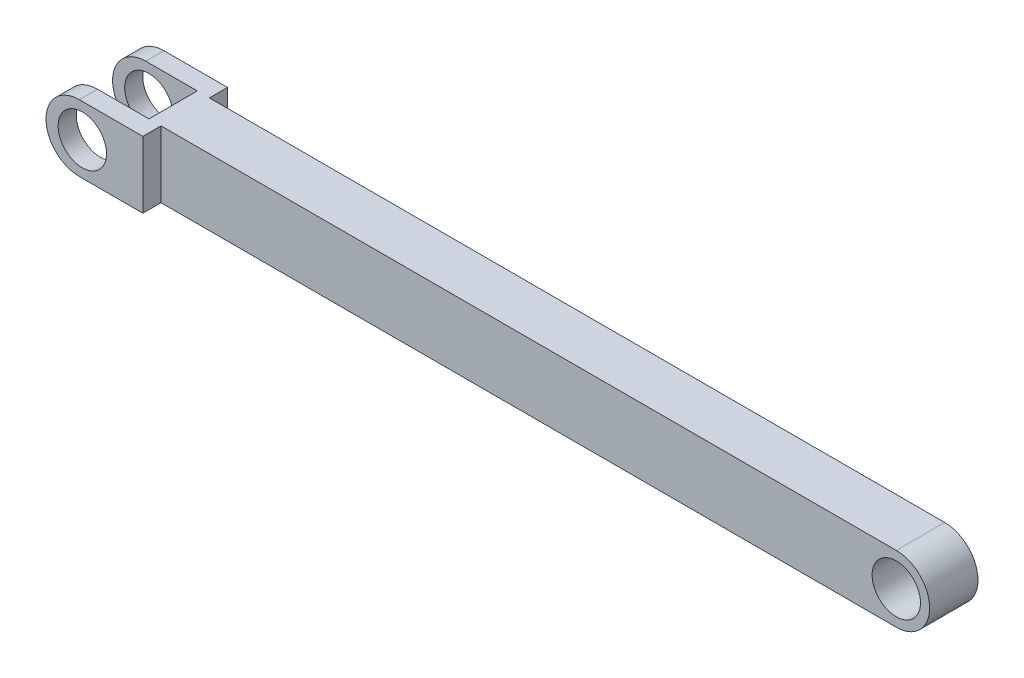
ISO-10303-21;
HEADER;
FILE_DESCRIPTION(('STEP AP214'),'2;1');
FILE_NAME('part.step','',(''),(''),'','','');
FILE_SCHEMA(('AUTOMOTIVE_DESIGN { 1 0 10303 214 1 1 1 1 }'));
ENDSEC;
DATA;
#1=APPLICATION_CONTEXT('core data for automotive mechanical design processes');
#2=APPLICATION_PROTOCOL_DEFINITION('international standard','automotive_design',2000,#1);
#3=PRODUCT_CONTEXT('',#1,'mechanical');
#4=PRODUCT('Part','Part','',(#3));
#5=PRODUCT_RELATED_PRODUCT_CATEGORY('part','',(#4));
#6=PRODUCT_DEFINITION_FORMATION('','',#4);
#7=PRODUCT_DEFINITION_CONTEXT('part definition',#1,'design');
#8=PRODUCT_DEFINITION('design','',#6,#7);
#9=PRODUCT_DEFINITION_SHAPE('','',#8);
#10=(LENGTH_UNIT() NAMED_UNIT(*) SI_UNIT(.MILLI.,.METRE.));
#11=(NAMED_UNIT(*) PLANE_ANGLE_UNIT() SI_UNIT($,.RADIAN.));
#12=(NAMED_UNIT(*) SI_UNIT($,.STERADIAN.) SOLID_ANGLE_UNIT());
#13=UNCERTAINTY_MEASURE_WITH_UNIT(LENGTH_MEASURE(1.E-05),#10,'distance_accuracy_value','');
#14=(GEOMETRIC_REPRESENTATION_CONTEXT(3) GLOBAL_UNCERTAINTY_ASSIGNED_CONTEXT((#13)) GLOBAL_UNIT_ASSIGNED_CONTEXT((#10,
#11,#12)) REPRESENTATION_CONTEXT('',''));
#15=CARTESIAN_POINT('',(0.,0.,0.));
#16=DIRECTION('',(0.,0.,1.));
#17=DIRECTION('',(1.,0.,0.));
#18=AXIS2_PLACEMENT_3D('',#15,#16,#17);
#19=CARTESIAN_POINT('',(0.,0.,4.));
#20=DIRECTION('',(0.,0.,-1.));
#21=DIRECTION('',(-1.,0.,0.));
#22=AXIS2_PLACEMENT_3D('',#19,#20,#21);
#23=PLANE('',#22);
#24=CARTESIAN_POINT('',(0.,0.,4.));
#25=DIRECTION('',(0.,0.,1.));
#26=DIRECTION('',(-1.,0.,0.));
#27=AXIS2_PLACEMENT_3D('',#24,#25,#26);
#28=CIRCLE('',#27,2.75);
#29=CARTESIAN_POINT('',(0.,-2.75,4.));
#30=VERTEX_POINT('',#29);
#31=CARTESIAN_POINT('',(0.,2.75,4.));
#32=VERTEX_POINT('',#31);
#33=EDGE_CURVE('E202',#30,#32,#28,.T.);
#34=ORIENTED_EDGE('',*,*,#33,.T.);
#35=DIRECTION('',(-1.,0.,0.));
#36=VECTOR('',#35,1.);
#37=CARTESIAN_POINT('',(0.,2.75,4.));
#38=LINE('',#37,#36);
#39=CARTESIAN_POINT('',(-60.75,2.75,4.));
#40=VERTEX_POINT('',#39);
#41=EDGE_CURVE('E205',#32,#40,#38,.T.);
#42=ORIENTED_EDGE('',*,*,#41,.T.);
#43=DIRECTION('',(0.,-1.,0.));
#44=VECTOR('',#43,1.);
#45=CARTESIAN_POINT('',(-60.75,2.74999999999999,4.));
#46=LINE('',#45,#44);
#47=CARTESIAN_POINT('',(-60.75,-2.75,4.));
#48=VERTEX_POINT('',#47);
#49=EDGE_CURVE('E209',#40,#48,#46,.T.);
#50=ORIENTED_EDGE('',*,*,#49,.T.);
#51=DIRECTION('',(1.,0.,0.));
#52=VECTOR('',#51,1.);
#53=CARTESIAN_POINT('',(-60.75,-2.75,4.));
#54=LINE('',#53,#52);
#55=EDGE_CURVE('E212',#48,#30,#54,.T.);
#56=ORIENTED_EDGE('',*,*,#55,.T.);
#57=EDGE_LOOP('',(#34,#42,#50,#56));
#58=FACE_BOUND('',#57,.T.);
#59=CARTESIAN_POINT('',(0.,0.,4.));
#60=DIRECTION('',(0.,0.,1.));
#61=DIRECTION('',(1.,0.,0.));
#62=AXIS2_PLACEMENT_3D('',#59,#60,#61);
#63=CIRCLE('',#62,2.);
#64=CARTESIAN_POINT('',(2.,0.,4.));
#65=VERTEX_POINT('',#64);
#66=EDGE_CURVE('E196',#65,#65,#63,.T.);
#67=ORIENTED_EDGE('',*,*,#66,.F.);
#68=EDGE_LOOP('',(#67));
#69=FACE_BOUND('',#68,.T.);
#70=ADVANCED_FACE('F37',(#58,#69),#23,.F.);
#71=CARTESIAN_POINT('',(0.,0.,0.));
#72=DIRECTION('',(0.,0.,-1.));
#73=DIRECTION('',(-1.,0.,0.));
#74=AXIS2_PLACEMENT_3D('',#71,#72,#73);
#75=PLANE('',#74);
#76=CARTESIAN_POINT('',(0.,0.,0.));
#77=DIRECTION('',(0.,0.,1.));
#78=DIRECTION('',(-1.,0.,0.));
#79=AXIS2_PLACEMENT_3D('',#76,#77,#78);
#80=CIRCLE('',#79,2.75);
#81=CARTESIAN_POINT('',(0.,-2.75,0.));
#82=VERTEX_POINT('',#81);
#83=CARTESIAN_POINT('',(0.,2.75,0.));
#84=VERTEX_POINT('',#83);
#85=EDGE_CURVE('E199',#82,#84,#80,.T.);
#86=ORIENTED_EDGE('',*,*,#85,.F.);
#87=DIRECTION('',(1.,0.,0.));
#88=VECTOR('',#87,1.);
#89=CARTESIAN_POINT('',(-60.75,-2.75,0.));
#90=LINE('',#89,#88);
#91=CARTESIAN_POINT('',(-60.75,-2.75,0.));
#92=VERTEX_POINT('',#91);
#93=EDGE_CURVE('E206',#92,#82,#90,.T.);
#94=ORIENTED_EDGE('',*,*,#93,.F.);
#95=DIRECTION('',(0.,-1.,0.));
#96=VECTOR('',#95,1.);
#97=CARTESIAN_POINT('',(-60.75,2.74999999999999,0.));
#98=LINE('',#97,#96);
#99=CARTESIAN_POINT('',(-60.75,2.75,0.));
#100=VERTEX_POINT('',#99);
#101=EDGE_CURVE('E220',#100,#92,#98,.T.);
#102=ORIENTED_EDGE('',*,*,#101,.F.);
#103=DIRECTION('',(-1.,0.,0.));
#104=VECTOR('',#103,1.);
#105=CARTESIAN_POINT('',(0.,2.75,0.));
#106=LINE('',#105,#104);
#107=EDGE_CURVE('E217',#84,#100,#106,.T.);
#108=ORIENTED_EDGE('',*,*,#107,.F.);
#109=EDGE_LOOP('',(#86,#94,#102,#108));
#110=FACE_BOUND('',#109,.T.);
#111=CARTESIAN_POINT('',(0.,0.,0.));
#112=DIRECTION('',(0.,0.,1.));
#113=DIRECTION('',(1.,0.,0.));
#114=AXIS2_PLACEMENT_3D('',#111,#112,#113);
#115=CIRCLE('',#114,2.);
#116=CARTESIAN_POINT('',(2.,0.,0.));
#117=VERTEX_POINT('',#116);
#118=EDGE_CURVE('E195',#117,#117,#115,.T.);
#119=ORIENTED_EDGE('',*,*,#118,.T.);
#120=EDGE_LOOP('',(#119));
#121=FACE_BOUND('',#120,.T.);
#122=ADVANCED_FACE('F300',(#110,#121),#75,.T.);
#123=CARTESIAN_POINT('',(0.,0.,4.));
#124=DIRECTION('',(0.,0.,-1.));
#125=DIRECTION('',(-1.,0.,0.));
#126=AXIS2_PLACEMENT_3D('',#123,#124,#125);
#127=CYLINDRICAL_SURFACE('',#126,2.75);
#128=ORIENTED_EDGE('',*,*,#85,.T.);
#129=DIRECTION('',(0.,0.,-1.));
#130=VECTOR('',#129,1.);
#131=CARTESIAN_POINT('',(0.,2.75,4.));
#132=LINE('',#131,#130);
#133=EDGE_CURVE('E225',#32,#84,#132,.T.);
#134=ORIENTED_EDGE('',*,*,#133,.F.);
#135=ORIENTED_EDGE('',*,*,#33,.F.);
#136=DIRECTION('',(0.,0.,-1.));
#137=VECTOR('',#136,1.);
#138=CARTESIAN_POINT('',(0.,-2.75,4.));
#139=LINE('',#138,#137);
#140=EDGE_CURVE('E214',#30,#82,#139,.T.);
#141=ORIENTED_EDGE('',*,*,#140,.T.);
#142=EDGE_LOOP('',(#128,#134,#135,#141));
#143=FACE_BOUND('',#142,.T.);
#144=ADVANCED_FACE('F294',(#143),#127,.T.);
#145=CARTESIAN_POINT('',(0.,2.75,4.));
#146=DIRECTION('',(0.,-1.,0.));
#147=DIRECTION('',(1.,0.,0.));
#148=AXIS2_PLACEMENT_3D('',#145,#146,#147);
#149=PLANE('',#148);
#150=DIRECTION('',(1.,0.,0.));
#151=VECTOR('',#150,1.);
#152=CARTESIAN_POINT('',(-68.75,2.75,-1.5));
#153=LINE('',#152,#151);
#154=CARTESIAN_POINT('',(-66.,2.75,-1.5));
#155=VERTEX_POINT('',#154);
#156=CARTESIAN_POINT('',(-60.75,2.75,-1.5));
#157=VERTEX_POINT('',#156);
#158=EDGE_CURVE('E187',#155,#157,#153,.T.);
#159=ORIENTED_EDGE('',*,*,#158,.F.);
#160=DIRECTION('',(0.,0.,-1.));
#161=VECTOR('',#160,1.);
#162=CARTESIAN_POINT('',(-66.,2.74999999999999,0.));
#163=LINE('',#162,#161);
#164=CARTESIAN_POINT('',(-66.,2.75,0.));
#165=VERTEX_POINT('',#164);
#166=EDGE_CURVE('E11',#155,#165,#163,.F.);
#167=ORIENTED_EDGE('',*,*,#166,.T.);
#168=DIRECTION('',(-1.,0.,0.));
#169=VECTOR('',#168,1.);
#170=CARTESIAN_POINT('',(-68.75,2.75,0.));
#171=LINE('',#170,#169);
#172=CARTESIAN_POINT('',(-61.75,2.75,0.));
#173=VERTEX_POINT('',#172);
#174=EDGE_CURVE('E162',#173,#165,#171,.T.);
#175=ORIENTED_EDGE('',*,*,#174,.F.);
#176=DIRECTION('',(0.,0.,-1.));
#177=VECTOR('',#176,1.);
#178=CARTESIAN_POINT('',(-61.75,2.75,0.));
#179=LINE('',#178,#177);
#180=CARTESIAN_POINT('',(-61.75,2.75,4.));
#181=VERTEX_POINT('',#180);
#182=EDGE_CURVE('E148',#181,#173,#179,.T.);
#183=ORIENTED_EDGE('',*,*,#182,.F.);
#184=DIRECTION('',(1.,0.,0.));
#185=VECTOR('',#184,1.);
#186=CARTESIAN_POINT('',(-68.75,2.75,4.));
#187=LINE('',#186,#185);
#188=CARTESIAN_POINT('',(-66.,2.75,4.));
#189=VERTEX_POINT('',#188);
#190=EDGE_CURVE('E137',#189,#181,#187,.T.);
#191=ORIENTED_EDGE('',*,*,#190,.F.);
#192=DIRECTION('',(0.,0.,-1.));
#193=VECTOR('',#192,1.);
#194=CARTESIAN_POINT('',(-66.,2.74999999999999,5.5));
#195=LINE('',#194,#193);
#196=CARTESIAN_POINT('',(-66.,2.75,5.5));
#197=VERTEX_POINT('',#196);
#198=EDGE_CURVE('E46',#189,#197,#195,.F.);
#199=ORIENTED_EDGE('',*,*,#198,.T.);
#200=DIRECTION('',(1.,0.,0.));
#201=VECTOR('',#200,1.);
#202=CARTESIAN_POINT('',(-68.75,2.75,5.5));
#203=LINE('',#202,#201);
#204=CARTESIAN_POINT('',(-60.75,2.75,5.5));
#205=VERTEX_POINT('',#204);
#206=EDGE_CURVE('E189',#197,#205,#203,.T.);
#207=ORIENTED_EDGE('',*,*,#206,.T.);
#208=DIRECTION('',(0.,0.,-1.));
#209=VECTOR('',#208,1.);
#210=CARTESIAN_POINT('',(-60.75,2.75,-1.5));
#211=LINE('',#210,#209);
#212=EDGE_CURVE('E184',#205,#40,#211,.T.);
#213=ORIENTED_EDGE('',*,*,#212,.T.);
#214=ORIENTED_EDGE('',*,*,#41,.F.);
#215=ORIENTED_EDGE('',*,*,#133,.T.);
#216=ORIENTED_EDGE('',*,*,#107,.T.);
#217=EDGE_CURVE('E183',#100,#157,#211,.T.);
#218=ORIENTED_EDGE('',*,*,#217,.T.);
#219=EDGE_LOOP('',(#159,#167,#175,#183,#191,#199,#207,#213,#214,#215,#216,#218));
#220=FACE_BOUND('',#219,.T.);
#221=ADVANCED_FACE('F160',(#220),#149,.F.);
#222=CARTESIAN_POINT('',(-60.75,-2.75,4.));
#223=DIRECTION('',(0.,1.,0.));
#224=DIRECTION('',(0.,0.,1.));
#225=AXIS2_PLACEMENT_3D('',#222,#223,#224);
#226=PLANE('',#225);
#227=DIRECTION('',(1.,0.,0.));
#228=VECTOR('',#227,1.);
#229=CARTESIAN_POINT('',(-68.75,-2.75,5.5));
#230=LINE('',#229,#228);
#231=CARTESIAN_POINT('',(-66.,-2.75,5.5));
#232=VERTEX_POINT('',#231);
#233=CARTESIAN_POINT('',(-60.75,-2.75,5.5));
#234=VERTEX_POINT('',#233);
#235=EDGE_CURVE('E191',#232,#234,#230,.T.);
#236=ORIENTED_EDGE('',*,*,#235,.F.);
#237=DIRECTION('',(0.,0.,1.));
#238=VECTOR('',#237,1.);
#239=CARTESIAN_POINT('',(-66.,-2.75,4.));
#240=LINE('',#239,#238);
#241=CARTESIAN_POINT('',(-66.,-2.75,4.));
#242=VERTEX_POINT('',#241);
#243=EDGE_CURVE('E239',#232,#242,#240,.F.);
#244=ORIENTED_EDGE('',*,*,#243,.T.);
#245=DIRECTION('',(1.,0.,0.));
#246=VECTOR('',#245,1.);
#247=CARTESIAN_POINT('',(-68.75,-2.75,4.));
#248=LINE('',#247,#246);
#249=CARTESIAN_POINT('',(-61.75,-2.75,4.));
#250=VERTEX_POINT('',#249);
#251=EDGE_CURVE('E164',#242,#250,#248,.T.);
#252=ORIENTED_EDGE('',*,*,#251,.T.);
#253=DIRECTION('',(0.,0.,-1.));
#254=VECTOR('',#253,1.);
#255=CARTESIAN_POINT('',(-61.75,-2.75,0.));
#256=LINE('',#255,#254);
#257=CARTESIAN_POINT('',(-61.75,-2.75,0.));
#258=VERTEX_POINT('',#257);
#259=EDGE_CURVE('E156',#250,#258,#256,.T.);
#260=ORIENTED_EDGE('',*,*,#259,.T.);
#261=DIRECTION('',(-1.,0.,0.));
#262=VECTOR('',#261,1.);
#263=CARTESIAN_POINT('',(-68.75,-2.75,0.));
#264=LINE('',#263,#262);
#265=CARTESIAN_POINT('',(-66.,-2.75,0.));
#266=VERTEX_POINT('',#265);
#267=EDGE_CURVE('E158',#258,#266,#264,.T.);
#268=ORIENTED_EDGE('',*,*,#267,.T.);
#269=DIRECTION('',(0.,0.,1.));
#270=VECTOR('',#269,1.);
#271=CARTESIAN_POINT('',(-66.,-2.75,-1.5));
#272=LINE('',#271,#270);
#273=CARTESIAN_POINT('',(-66.,-2.75,-1.5));
#274=VERTEX_POINT('',#273);
#275=EDGE_CURVE('E236',#266,#274,#272,.F.);
#276=ORIENTED_EDGE('',*,*,#275,.T.);
#277=DIRECTION('',(1.,0.,0.));
#278=VECTOR('',#277,1.);
#279=CARTESIAN_POINT('',(-68.75,-2.75,-1.5));
#280=LINE('',#279,#278);
#281=CARTESIAN_POINT('',(-60.75,-2.75,-1.5));
#282=VERTEX_POINT('',#281);
#283=EDGE_CURVE('E193',#274,#282,#280,.T.);
#284=ORIENTED_EDGE('',*,*,#283,.T.);
#285=DIRECTION('',(0.,0.,1.));
#286=VECTOR('',#285,1.);
#287=CARTESIAN_POINT('',(-60.75,-2.75,-1.5));
#288=LINE('',#287,#286);
#289=EDGE_CURVE('E177',#282,#92,#288,.T.);
#290=ORIENTED_EDGE('',*,*,#289,.T.);
#291=ORIENTED_EDGE('',*,*,#93,.T.);
#292=ORIENTED_EDGE('',*,*,#140,.F.);
#293=ORIENTED_EDGE('',*,*,#55,.F.);
#294=EDGE_CURVE('E176',#48,#234,#288,.T.);
#295=ORIENTED_EDGE('',*,*,#294,.T.);
#296=EDGE_LOOP('',(#236,#244,#252,#260,#268,#276,#284,#290,#291,#292,#293,#295));
#297=FACE_BOUND('',#296,.T.);
#298=ADVANCED_FACE('F274',(#297),#226,.F.);
#299=CARTESIAN_POINT('',(0.,0.,4.));
#300=DIRECTION('',(0.,0.,-1.));
#301=DIRECTION('',(-1.,0.,0.));
#302=AXIS2_PLACEMENT_3D('',#299,#300,#301);
#303=CYLINDRICAL_SURFACE('',#302,2.);
#304=ORIENTED_EDGE('',*,*,#66,.T.);
#305=EDGE_LOOP('',(#304));
#306=FACE_BOUND('',#305,.T.);
#307=ORIENTED_EDGE('',*,*,#118,.F.);
#308=EDGE_LOOP('',(#307));
#309=FACE_BOUND('',#308,.T.);
#310=ADVANCED_FACE('F315',(#306,#309),#303,.F.);
#311=CARTESIAN_POINT('',(-60.75,0.,0.));
#312=DIRECTION('',(-1.,0.,0.));
#313=DIRECTION('',(0.,0.,1.));
#314=AXIS2_PLACEMENT_3D('',#311,#312,#313);
#315=PLANE('',#314);
#316=ORIENTED_EDGE('',*,*,#217,.F.);
#317=ORIENTED_EDGE('',*,*,#101,.T.);
#318=ORIENTED_EDGE('',*,*,#289,.F.);
#319=DIRECTION('',(0.,-1.,0.));
#320=VECTOR('',#319,1.);
#321=CARTESIAN_POINT('',(-60.75,2.75,-1.5));
#322=LINE('',#321,#320);
#323=EDGE_CURVE('E172',#157,#282,#322,.T.);
#324=ORIENTED_EDGE('',*,*,#323,.F.);
#325=EDGE_LOOP('',(#316,#317,#318,#324));
#326=FACE_BOUND('',#325,.T.);
#327=ADVANCED_FACE('F304',(#326),#315,.F.);
#328=CARTESIAN_POINT('',(-68.75,2.75,-1.5));
#329=DIRECTION('',(0.,0.,1.));
#330=DIRECTION('',(0.,-1.,0.));
#331=AXIS2_PLACEMENT_3D('',#328,#329,#330);
#332=PLANE('',#331);
#333=CARTESIAN_POINT('',(-65.75,0.,-1.5));
#334=DIRECTION('',(0.,0.,1.));
#335=DIRECTION('',(1.,0.,0.));
#336=AXIS2_PLACEMENT_3D('',#333,#334,#335);
#337=CIRCLE('',#336,2.);
#338=CARTESIAN_POINT('',(-63.75,0.,-1.5));
#339=VERTEX_POINT('',#338);
#340=EDGE_CURVE('E232',#339,#339,#337,.T.);
#341=ORIENTED_EDGE('',*,*,#340,.T.);
#342=EDGE_LOOP('',(#341));
#343=FACE_BOUND('',#342,.T.);
#344=ORIENTED_EDGE('',*,*,#283,.F.);
#345=CARTESIAN_POINT('',(-66.,0.,-1.5));
#346=DIRECTION('',(0.,0.,1.));
#347=DIRECTION('',(0.,-1.,0.));
#348=AXIS2_PLACEMENT_3D('',#345,#346,#347);
#349=CIRCLE('',#348,2.75);
#350=CARTESIAN_POINT('',(-68.75,0.,-1.5));
#351=VERTEX_POINT('',#350);
#352=EDGE_CURVE('E59',#274,#351,#349,.F.);
#353=ORIENTED_EDGE('',*,*,#352,.T.);
#354=CARTESIAN_POINT('',(-66.,0.,-1.5));
#355=DIRECTION('',(0.,0.,1.));
#356=DIRECTION('',(0.,-1.,0.));
#357=AXIS2_PLACEMENT_3D('',#354,#355,#356);
#358=CIRCLE('',#357,2.75);
#359=EDGE_CURVE('E54',#351,#155,#358,.F.);
#360=ORIENTED_EDGE('',*,*,#359,.T.);
#361=ORIENTED_EDGE('',*,*,#158,.T.);
#362=ORIENTED_EDGE('',*,*,#323,.T.);
#363=EDGE_LOOP('',(#344,#353,#360,#361,#362));
#364=FACE_BOUND('',#363,.T.);
#365=ADVANCED_FACE('F305',(#343,#364),#332,.F.);
#366=CARTESIAN_POINT('',(-68.75,2.75,5.5));
#367=DIRECTION('',(0.,0.,-1.));
#368=DIRECTION('',(-1.,0.,0.));
#369=AXIS2_PLACEMENT_3D('',#366,#367,#368);
#370=PLANE('',#369);
#371=CARTESIAN_POINT('',(-65.75,0.,5.5));
#372=DIRECTION('',(0.,0.,1.));
#373=DIRECTION('',(1.,0.,0.));
#374=AXIS2_PLACEMENT_3D('',#371,#372,#373);
#375=CIRCLE('',#374,2.);
#376=CARTESIAN_POINT('',(-63.75,0.,5.5));
#377=VERTEX_POINT('',#376);
#378=EDGE_CURVE('E253',#377,#377,#375,.T.);
#379=ORIENTED_EDGE('',*,*,#378,.F.);
#380=EDGE_LOOP('',(#379));
#381=FACE_BOUND('',#380,.T.);
#382=CARTESIAN_POINT('',(-66.,0.,5.5));
#383=DIRECTION('',(0.,0.,-1.));
#384=DIRECTION('',(-1.,0.,0.));
#385=AXIS2_PLACEMENT_3D('',#382,#383,#384);
#386=CIRCLE('',#385,2.75);
#387=CARTESIAN_POINT('',(-68.75,0.,5.5));
#388=VERTEX_POINT('',#387);
#389=EDGE_CURVE('E228',#197,#388,#386,.F.);
#390=ORIENTED_EDGE('',*,*,#389,.T.);
#391=CARTESIAN_POINT('',(-66.,0.,5.5));
#392=DIRECTION('',(0.,0.,-1.));
#393=DIRECTION('',(-1.,0.,0.));
#394=AXIS2_PLACEMENT_3D('',#391,#392,#393);
#395=CIRCLE('',#394,2.75);
#396=EDGE_CURVE('E234',#388,#232,#395,.F.);
#397=ORIENTED_EDGE('',*,*,#396,.T.);
#398=ORIENTED_EDGE('',*,*,#235,.T.);
#399=DIRECTION('',(0.,1.,0.));
#400=VECTOR('',#399,1.);
#401=CARTESIAN_POINT('',(-60.75,2.75,5.5));
#402=LINE('',#401,#400);
#403=EDGE_CURVE('E180',#234,#205,#402,.T.);
#404=ORIENTED_EDGE('',*,*,#403,.T.);
#405=ORIENTED_EDGE('',*,*,#206,.F.);
#406=EDGE_LOOP('',(#390,#397,#398,#404,#405));
#407=FACE_BOUND('',#406,.T.);
#408=ADVANCED_FACE('F281',(#381,#407),#370,.F.);
#409=ORIENTED_EDGE('',*,*,#49,.F.);
#410=ORIENTED_EDGE('',*,*,#212,.F.);
#411=ORIENTED_EDGE('',*,*,#403,.F.);
#412=ORIENTED_EDGE('',*,*,#294,.F.);
#413=EDGE_LOOP('',(#409,#410,#411,#412));
#414=FACE_BOUND('',#413,.T.);
#415=ADVANCED_FACE('F286',(#414),#315,.F.);
#416=CARTESIAN_POINT('',(-68.75,-2.75,0.));
#417=DIRECTION('',(0.,0.,-1.));
#418=DIRECTION('',(-1.,0.,0.));
#419=AXIS2_PLACEMENT_3D('',#416,#417,#418);
#420=PLANE('',#419);
#421=CARTESIAN_POINT('',(-65.75,0.,0.));
#422=DIRECTION('',(0.,0.,-1.));
#423=DIRECTION('',(-1.,0.,0.));
#424=AXIS2_PLACEMENT_3D('',#421,#422,#423);
#425=CIRCLE('',#424,2.);
#426=CARTESIAN_POINT('',(-67.75,0.,0.));
#427=VERTEX_POINT('',#426);
#428=EDGE_CURVE('E149',#427,#427,#425,.T.);
#429=ORIENTED_EDGE('',*,*,#428,.T.);
#430=EDGE_LOOP('',(#429));
#431=FACE_BOUND('',#430,.T.);
#432=CARTESIAN_POINT('',(-66.,0.,0.));
#433=DIRECTION('',(0.,0.,-1.));
#434=DIRECTION('',(-1.,0.,0.));
#435=AXIS2_PLACEMENT_3D('',#432,#433,#434);
#436=CIRCLE('',#435,2.75);
#437=CARTESIAN_POINT('',(-68.75,0.,0.));
#438=VERTEX_POINT('',#437);
#439=EDGE_CURVE('E245',#165,#438,#436,.F.);
#440=ORIENTED_EDGE('',*,*,#439,.T.);
#441=CARTESIAN_POINT('',(-66.,0.,0.));
#442=DIRECTION('',(0.,0.,-1.));
#443=DIRECTION('',(-1.,0.,0.));
#444=AXIS2_PLACEMENT_3D('',#441,#442,#443);
#445=CIRCLE('',#444,2.75);
#446=EDGE_CURVE('E247',#438,#266,#445,.F.);
#447=ORIENTED_EDGE('',*,*,#446,.T.);
#448=ORIENTED_EDGE('',*,*,#267,.F.);
#449=DIRECTION('',(0.,1.,0.));
#450=VECTOR('',#449,1.);
#451=CARTESIAN_POINT('',(-61.75,-2.75,0.));
#452=LINE('',#451,#450);
#453=EDGE_CURVE('E157',#258,#173,#452,.T.);
#454=ORIENTED_EDGE('',*,*,#453,.T.);
#455=ORIENTED_EDGE('',*,*,#174,.T.);
#456=EDGE_LOOP('',(#440,#447,#448,#454,#455));
#457=FACE_BOUND('',#456,.T.);
#458=ADVANCED_FACE('F270',(#431,#457),#420,.F.);
#459=CARTESIAN_POINT('',(-61.75,-2.75,0.));
#460=DIRECTION('',(1.,0.,0.));
#461=DIRECTION('',(0.,0.,-1.));
#462=AXIS2_PLACEMENT_3D('',#459,#460,#461);
#463=PLANE('',#462);
#464=ORIENTED_EDGE('',*,*,#453,.F.);
#465=ORIENTED_EDGE('',*,*,#259,.F.);
#466=DIRECTION('',(0.,1.,0.));
#467=VECTOR('',#466,1.);
#468=CARTESIAN_POINT('',(-61.75,-2.75,4.));
#469=LINE('',#468,#467);
#470=EDGE_CURVE('E141',#250,#181,#469,.T.);
#471=ORIENTED_EDGE('',*,*,#470,.T.);
#472=ORIENTED_EDGE('',*,*,#182,.T.);
#473=EDGE_LOOP('',(#464,#465,#471,#472));
#474=FACE_BOUND('',#473,.T.);
#475=ADVANCED_FACE('F153',(#474),#463,.F.);
#476=CARTESIAN_POINT('',(-68.75,-2.75,4.));
#477=DIRECTION('',(0.,0.,1.));
#478=DIRECTION('',(1.,0.,0.));
#479=AXIS2_PLACEMENT_3D('',#476,#477,#478);
#480=PLANE('',#479);
#481=CARTESIAN_POINT('',(-65.75,0.,4.));
#482=DIRECTION('',(0.,0.,1.));
#483=DIRECTION('',(1.,0.,0.));
#484=AXIS2_PLACEMENT_3D('',#481,#482,#483);
#485=CIRCLE('',#484,2.);
#486=CARTESIAN_POINT('',(-63.75,0.,4.));
#487=VERTEX_POINT('',#486);
#488=EDGE_CURVE('E229',#487,#487,#485,.T.);
#489=ORIENTED_EDGE('',*,*,#488,.T.);
#490=EDGE_LOOP('',(#489));
#491=FACE_BOUND('',#490,.T.);
#492=ORIENTED_EDGE('',*,*,#251,.F.);
#493=CARTESIAN_POINT('',(-66.,0.,4.));
#494=DIRECTION('',(0.,0.,1.));
#495=DIRECTION('',(1.,0.,0.));
#496=AXIS2_PLACEMENT_3D('',#493,#494,#495);
#497=CIRCLE('',#496,2.75);
#498=CARTESIAN_POINT('',(-68.75,0.,4.));
#499=VERTEX_POINT('',#498);
#500=EDGE_CURVE('E243',#242,#499,#497,.F.);
#501=ORIENTED_EDGE('',*,*,#500,.T.);
#502=CARTESIAN_POINT('',(-66.,0.,4.));
#503=DIRECTION('',(0.,0.,1.));
#504=DIRECTION('',(1.,0.,0.));
#505=AXIS2_PLACEMENT_3D('',#502,#503,#504);
#506=CIRCLE('',#505,2.75);
#507=EDGE_CURVE('E144',#499,#189,#506,.F.);
#508=ORIENTED_EDGE('',*,*,#507,.T.);
#509=ORIENTED_EDGE('',*,*,#190,.T.);
#510=ORIENTED_EDGE('',*,*,#470,.F.);
#511=EDGE_LOOP('',(#492,#501,#508,#509,#510));
#512=FACE_BOUND('',#511,.T.);
#513=ADVANCED_FACE('F140',(#491,#512),#480,.F.);
#514=CARTESIAN_POINT('',(-65.75,0.,-1.5));
#515=DIRECTION('',(0.,0.,1.));
#516=DIRECTION('',(1.,0.,0.));
#517=AXIS2_PLACEMENT_3D('',#514,#515,#516);
#518=CYLINDRICAL_SURFACE('',#517,2.);
#519=ORIENTED_EDGE('',*,*,#378,.T.);
#520=EDGE_LOOP('',(#519));
#521=FACE_BOUND('',#520,.T.);
#522=ORIENTED_EDGE('',*,*,#488,.F.);
#523=EDGE_LOOP('',(#522));
#524=FACE_BOUND('',#523,.T.);
#525=ADVANCED_FACE('F358',(#521,#524),#518,.F.);
#526=ORIENTED_EDGE('',*,*,#340,.F.);
#527=EDGE_LOOP('',(#526));
#528=FACE_BOUND('',#527,.T.);
#529=ORIENTED_EDGE('',*,*,#428,.F.);
#530=EDGE_LOOP('',(#529));
#531=FACE_BOUND('',#530,.T.);
#532=ADVANCED_FACE('F336',(#528,#531),#518,.F.);
#533=CARTESIAN_POINT('',(-66.,0.,0.));
#534=DIRECTION('',(0.,0.,1.));
#535=DIRECTION('',(1.,0.,0.));
#536=AXIS2_PLACEMENT_3D('',#533,#534,#535);
#537=CYLINDRICAL_SURFACE('',#536,2.75);
#538=ORIENTED_EDGE('',*,*,#198,.F.);
#539=ORIENTED_EDGE('',*,*,#507,.F.);
#540=DIRECTION('',(0.,0.,-1.));
#541=VECTOR('',#540,1.);
#542=CARTESIAN_POINT('',(-68.75,0.,4.));
#543=LINE('',#542,#541);
#544=EDGE_CURVE('E251',#388,#499,#543,.T.);
#545=ORIENTED_EDGE('',*,*,#544,.F.);
#546=ORIENTED_EDGE('',*,*,#389,.F.);
#547=EDGE_LOOP('',(#538,#539,#545,#546));
#548=FACE_BOUND('',#547,.T.);
#549=ADVANCED_FACE('F277',(#548),#537,.T.);
#550=CARTESIAN_POINT('',(-66.,0.,0.));
#551=DIRECTION('',(0.,0.,-1.));
#552=DIRECTION('',(-1.,0.,0.));
#553=AXIS2_PLACEMENT_3D('',#550,#551,#552);
#554=CYLINDRICAL_SURFACE('',#553,2.75);
#555=ORIENTED_EDGE('',*,*,#500,.F.);
#556=ORIENTED_EDGE('',*,*,#243,.F.);
#557=ORIENTED_EDGE('',*,*,#396,.F.);
#558=ORIENTED_EDGE('',*,*,#544,.T.);
#559=EDGE_LOOP('',(#555,#556,#557,#558));
#560=FACE_BOUND('',#559,.T.);
#561=ADVANCED_FACE('F332',(#560),#554,.T.);
#562=CARTESIAN_POINT('',(-66.,0.,0.));
#563=DIRECTION('',(0.,0.,1.));
#564=DIRECTION('',(1.,0.,0.));
#565=AXIS2_PLACEMENT_3D('',#562,#563,#564);
#566=CYLINDRICAL_SURFACE('',#565,2.75);
#567=ORIENTED_EDGE('',*,*,#166,.F.);
#568=ORIENTED_EDGE('',*,*,#359,.F.);
#569=DIRECTION('',(0.,0.,-1.));
#570=VECTOR('',#569,1.);
#571=CARTESIAN_POINT('',(-68.75,0.,-1.5));
#572=LINE('',#571,#570);
#573=EDGE_CURVE('E41',#438,#351,#572,.T.);
#574=ORIENTED_EDGE('',*,*,#573,.F.);
#575=ORIENTED_EDGE('',*,*,#439,.F.);
#576=EDGE_LOOP('',(#567,#568,#574,#575));
#577=FACE_BOUND('',#576,.T.);
#578=ADVANCED_FACE('F39',(#577),#566,.T.);
#579=CARTESIAN_POINT('',(-66.,0.,0.));
#580=DIRECTION('',(0.,0.,-1.));
#581=DIRECTION('',(-1.,0.,0.));
#582=AXIS2_PLACEMENT_3D('',#579,#580,#581);
#583=CYLINDRICAL_SURFACE('',#582,2.75);
#584=ORIENTED_EDGE('',*,*,#352,.F.);
#585=ORIENTED_EDGE('',*,*,#275,.F.);
#586=ORIENTED_EDGE('',*,*,#446,.F.);
#587=ORIENTED_EDGE('',*,*,#573,.T.);
#588=EDGE_LOOP('',(#584,#585,#586,#587));
#589=FACE_BOUND('',#588,.T.);
#590=ADVANCED_FACE('F263',(#589),#583,.T.);
#591=CLOSED_SHELL('',(#70,#122,#144,#221,#298,#310,#327,#365,#408,#415,#458,#475,#513,#525,#532,
#549,#561,#578,#590));
#592=MANIFOLD_SOLID_BREP('B2',#591);
#593=ADVANCED_BREP_SHAPE_REPRESENTATION('',(#18,#592),#14);
#594=SHAPE_DEFINITION_REPRESENTATION(#9,#593);
ENDSEC;
END-ISO-10303-21;
